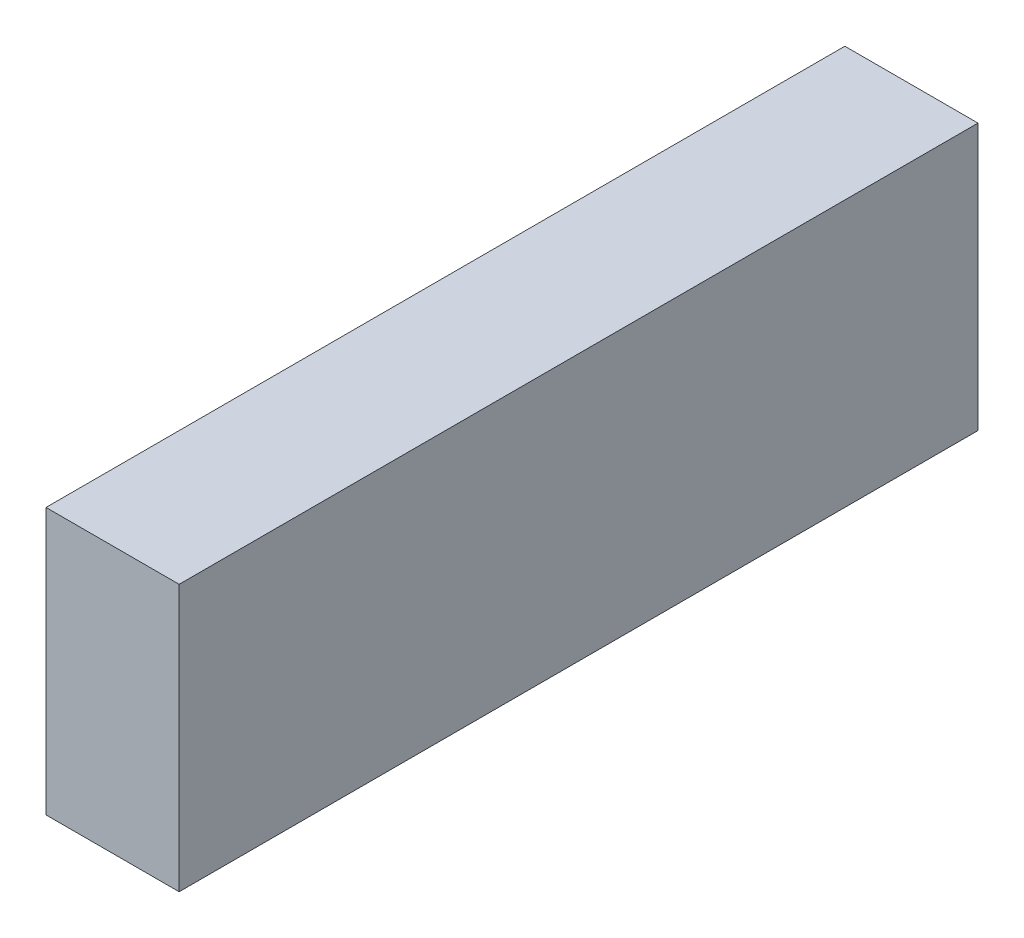
ISO-10303-21;
HEADER;
FILE_DESCRIPTION(('STEP AP214'),'2;1');
FILE_NAME('part.step','',(''),(''),'','','');
FILE_SCHEMA(('AUTOMOTIVE_DESIGN { 1 0 10303 214 1 1 1 1 }'));
ENDSEC;
DATA;
#1=APPLICATION_CONTEXT('core data for automotive mechanical design processes');
#2=APPLICATION_PROTOCOL_DEFINITION('international standard','automotive_design',2000,#1);
#3=PRODUCT_CONTEXT('',#1,'mechanical');
#4=PRODUCT('Part','Part','',(#3));
#5=PRODUCT_RELATED_PRODUCT_CATEGORY('part','',(#4));
#6=PRODUCT_DEFINITION_FORMATION('','',#4);
#7=PRODUCT_DEFINITION_CONTEXT('part definition',#1,'design');
#8=PRODUCT_DEFINITION('design','',#6,#7);
#9=PRODUCT_DEFINITION_SHAPE('','',#8);
#10=(LENGTH_UNIT() NAMED_UNIT(*) SI_UNIT(.MILLI.,.METRE.));
#11=(NAMED_UNIT(*) PLANE_ANGLE_UNIT() SI_UNIT($,.RADIAN.));
#12=(NAMED_UNIT(*) SI_UNIT($,.STERADIAN.) SOLID_ANGLE_UNIT());
#13=UNCERTAINTY_MEASURE_WITH_UNIT(LENGTH_MEASURE(1.E-05),#10,'distance_accuracy_value','');
#14=(GEOMETRIC_REPRESENTATION_CONTEXT(3) GLOBAL_UNCERTAINTY_ASSIGNED_CONTEXT((#13)) GLOBAL_UNIT_ASSIGNED_CONTEXT((#10,
#11,#12)) REPRESENTATION_CONTEXT('',''));
#15=CARTESIAN_POINT('',(0.,0.,0.));
#16=DIRECTION('',(0.,0.,1.));
#17=DIRECTION('',(1.,0.,0.));
#18=AXIS2_PLACEMENT_3D('',#15,#16,#17);
#19=CARTESIAN_POINT('',(220.,-32.3,392.64406037513));
#20=DIRECTION('',(0.,0.,-1.));
#21=DIRECTION('',(-1.,0.,0.));
#22=AXIS2_PLACEMENT_3D('',#19,#20,#21);
#23=PLANE('',#22);
#24=DIRECTION('',(0.,-1.,0.));
#25=VECTOR('',#24,1.);
#26=CARTESIAN_POINT('',(0.,-32.3,392.64406037513));
#27=LINE('',#26,#25);
#28=CARTESIAN_POINT('',(0.,407.7,392.64406037513));
#29=VERTEX_POINT('',#28);
#30=CARTESIAN_POINT('',(0.,-32.3,392.64406037513));
#31=VERTEX_POINT('',#30);
#32=EDGE_CURVE('E109',#29,#31,#27,.T.);
#33=ORIENTED_EDGE('',*,*,#32,.T.);
#34=DIRECTION('',(-1.,0.,0.));
#35=VECTOR('',#34,1.);
#36=CARTESIAN_POINT('',(220.,-32.3,392.64406037513));
#37=LINE('',#36,#35);
#38=CARTESIAN_POINT('',(220.,-32.3,392.64406037513));
#39=VERTEX_POINT('',#38);
#40=EDGE_CURVE('E12',#39,#31,#37,.T.);
#41=ORIENTED_EDGE('',*,*,#40,.F.);
#42=DIRECTION('',(0.,-1.,0.));
#43=VECTOR('',#42,1.);
#44=CARTESIAN_POINT('',(220.,-32.3,392.64406037513));
#45=LINE('',#44,#43);
#46=CARTESIAN_POINT('',(220.,407.7,392.64406037513));
#47=VERTEX_POINT('',#46);
#48=EDGE_CURVE('E97',#47,#39,#45,.T.);
#49=ORIENTED_EDGE('',*,*,#48,.F.);
#50=DIRECTION('',(-1.,0.,0.));
#51=VECTOR('',#50,1.);
#52=CARTESIAN_POINT('',(220.,407.7,392.64406037513));
#53=LINE('',#52,#51);
#54=EDGE_CURVE('E105',#47,#29,#53,.T.);
#55=ORIENTED_EDGE('',*,*,#54,.T.);
#56=EDGE_LOOP('',(#33,#41,#49,#55));
#57=FACE_BOUND('',#56,.T.);
#58=ADVANCED_FACE('F46',(#57),#23,.F.);
#59=CARTESIAN_POINT('',(220.,-32.3,392.64406037513));
#60=DIRECTION('',(0.,1.,0.));
#61=DIRECTION('',(0.,0.,1.));
#62=AXIS2_PLACEMENT_3D('',#59,#60,#61);
#63=PLANE('',#62);
#64=DIRECTION('',(0.,0.,-1.));
#65=VECTOR('',#64,1.);
#66=CARTESIAN_POINT('',(0.,-32.3,392.64406037513));
#67=LINE('',#66,#65);
#68=CARTESIAN_POINT('',(0.,-32.3,-487.35593962487));
#69=VERTEX_POINT('',#68);
#70=EDGE_CURVE('E101',#31,#69,#67,.T.);
#71=ORIENTED_EDGE('',*,*,#70,.T.);
#72=DIRECTION('',(-1.,0.,0.));
#73=VECTOR('',#72,1.);
#74=CARTESIAN_POINT('',(220.,-32.3,-487.35593962487));
#75=LINE('',#74,#73);
#76=CARTESIAN_POINT('',(220.,-32.3,-487.35593962487));
#77=VERTEX_POINT('',#76);
#78=EDGE_CURVE('E54',#77,#69,#75,.T.);
#79=ORIENTED_EDGE('',*,*,#78,.F.);
#80=DIRECTION('',(0.,0.,-1.));
#81=VECTOR('',#80,1.);
#82=CARTESIAN_POINT('',(220.,-32.3,392.64406037513));
#83=LINE('',#82,#81);
#84=EDGE_CURVE('E92',#39,#77,#83,.T.);
#85=ORIENTED_EDGE('',*,*,#84,.F.);
#86=ORIENTED_EDGE('',*,*,#40,.T.);
#87=EDGE_LOOP('',(#71,#79,#85,#86));
#88=FACE_BOUND('',#87,.T.);
#89=ADVANCED_FACE('F100',(#88),#63,.F.);
#90=CARTESIAN_POINT('',(220.,-32.3,-487.35593962487));
#91=DIRECTION('',(0.,0.,1.));
#92=DIRECTION('',(1.,0.,0.));
#93=AXIS2_PLACEMENT_3D('',#90,#91,#92);
#94=PLANE('',#93);
#95=DIRECTION('',(0.,1.,0.));
#96=VECTOR('',#95,1.);
#97=CARTESIAN_POINT('',(0.,-32.3,-487.35593962487));
#98=LINE('',#97,#96);
#99=CARTESIAN_POINT('',(0.,407.7,-487.35593962487));
#100=VERTEX_POINT('',#99);
#101=EDGE_CURVE('E79',#69,#100,#98,.T.);
#102=ORIENTED_EDGE('',*,*,#101,.T.);
#103=DIRECTION('',(-1.,0.,0.));
#104=VECTOR('',#103,1.);
#105=CARTESIAN_POINT('',(220.,407.7,-487.35593962487));
#106=LINE('',#105,#104);
#107=CARTESIAN_POINT('',(220.,407.7,-487.35593962487));
#108=VERTEX_POINT('',#107);
#109=EDGE_CURVE('E102',#108,#100,#106,.T.);
#110=ORIENTED_EDGE('',*,*,#109,.F.);
#111=DIRECTION('',(0.,1.,0.));
#112=VECTOR('',#111,1.);
#113=CARTESIAN_POINT('',(220.,-32.3,-487.35593962487));
#114=LINE('',#113,#112);
#115=EDGE_CURVE('E95',#77,#108,#114,.T.);
#116=ORIENTED_EDGE('',*,*,#115,.F.);
#117=ORIENTED_EDGE('',*,*,#78,.T.);
#118=EDGE_LOOP('',(#102,#110,#116,#117));
#119=FACE_BOUND('',#118,.T.);
#120=ADVANCED_FACE('F103',(#119),#94,.F.);
#121=CARTESIAN_POINT('',(220.,407.7,392.64406037513));
#122=DIRECTION('',(0.,-1.,0.));
#123=DIRECTION('',(0.,0.,-1.));
#124=AXIS2_PLACEMENT_3D('',#121,#122,#123);
#125=PLANE('',#124);
#126=DIRECTION('',(0.,0.,1.));
#127=VECTOR('',#126,1.);
#128=CARTESIAN_POINT('',(0.,407.7,392.64406037513));
#129=LINE('',#128,#127);
#130=EDGE_CURVE('E85',#100,#29,#129,.T.);
#131=ORIENTED_EDGE('',*,*,#130,.T.);
#132=ORIENTED_EDGE('',*,*,#54,.F.);
#133=DIRECTION('',(0.,0.,1.));
#134=VECTOR('',#133,1.);
#135=CARTESIAN_POINT('',(220.,407.7,392.64406037513));
#136=LINE('',#135,#134);
#137=EDGE_CURVE('E62',#108,#47,#136,.T.);
#138=ORIENTED_EDGE('',*,*,#137,.F.);
#139=ORIENTED_EDGE('',*,*,#109,.T.);
#140=EDGE_LOOP('',(#131,#132,#138,#139));
#141=FACE_BOUND('',#140,.T.);
#142=ADVANCED_FACE('F116',(#141),#125,.F.);
#143=CARTESIAN_POINT('',(220.,0.,0.));
#144=DIRECTION('',(-1.,0.,0.));
#145=DIRECTION('',(0.,0.,1.));
#146=AXIS2_PLACEMENT_3D('',#143,#144,#145);
#147=PLANE('',#146);
#148=ORIENTED_EDGE('',*,*,#48,.T.);
#149=ORIENTED_EDGE('',*,*,#84,.T.);
#150=ORIENTED_EDGE('',*,*,#115,.T.);
#151=ORIENTED_EDGE('',*,*,#137,.T.);
#152=EDGE_LOOP('',(#148,#149,#150,#151));
#153=FACE_BOUND('',#152,.T.);
#154=ADVANCED_FACE('F93',(#153),#147,.F.);
#155=CARTESIAN_POINT('',(0.,0.,0.));
#156=DIRECTION('',(-1.,0.,0.));
#157=DIRECTION('',(0.,0.,1.));
#158=AXIS2_PLACEMENT_3D('',#155,#156,#157);
#159=PLANE('',#158);
#160=ORIENTED_EDGE('',*,*,#32,.F.);
#161=ORIENTED_EDGE('',*,*,#130,.F.);
#162=ORIENTED_EDGE('',*,*,#101,.F.);
#163=ORIENTED_EDGE('',*,*,#70,.F.);
#164=EDGE_LOOP('',(#160,#161,#162,#163));
#165=FACE_BOUND('',#164,.T.);
#166=ADVANCED_FACE('F119',(#165),#159,.T.);
#167=CLOSED_SHELL('',(#58,#89,#120,#142,#154,#166));
#168=MANIFOLD_SOLID_BREP('B2_NOT_SHOWN',#167);
#169=CARTESIAN_POINT('',(1000.,-32.3,2192.64406037513));
#170=DIRECTION('',(0.,0.,-1.));
#171=DIRECTION('',(-1.,0.,0.));
#172=AXIS2_PLACEMENT_3D('',#169,#170,#171);
#173=PLANE('',#172);
#174=DIRECTION('',(0.,-1.,0.));
#175=VECTOR('',#174,1.);
#176=CARTESIAN_POINT('',(0.,-32.3,2192.64406037513));
#177=LINE('',#176,#175);
#178=CARTESIAN_POINT('',(0.,1967.7,2192.64406037513));
#179=VERTEX_POINT('',#178);
#180=CARTESIAN_POINT('',(0.,-32.3,2192.64406037513));
#181=VERTEX_POINT('',#180);
#182=EDGE_CURVE('E242',#179,#181,#177,.T.);
#183=ORIENTED_EDGE('',*,*,#182,.T.);
#184=DIRECTION('',(-1.,0.,0.));
#185=VECTOR('',#184,1.);
#186=CARTESIAN_POINT('',(1000.,-32.3,2192.64406037513));
#187=LINE('',#186,#185);
#188=CARTESIAN_POINT('',(1000.,-32.3,2192.64406037513));
#189=VERTEX_POINT('',#188);
#190=EDGE_CURVE('E44',#189,#181,#187,.T.);
#191=ORIENTED_EDGE('',*,*,#190,.F.);
#192=DIRECTION('',(0.,-1.,0.));
#193=VECTOR('',#192,1.);
#194=CARTESIAN_POINT('',(1000.,-32.3,2192.64406037513));
#195=LINE('',#194,#193);
#196=CARTESIAN_POINT('',(1000.,1967.7,2192.64406037513));
#197=VERTEX_POINT('',#196);
#198=EDGE_CURVE('E230',#197,#189,#195,.T.);
#199=ORIENTED_EDGE('',*,*,#198,.F.);
#200=DIRECTION('',(-1.,0.,0.));
#201=VECTOR('',#200,1.);
#202=CARTESIAN_POINT('',(1000.,1967.7,2192.64406037513));
#203=LINE('',#202,#201);
#204=EDGE_CURVE('E238',#197,#179,#203,.T.);
#205=ORIENTED_EDGE('',*,*,#204,.T.);
#206=EDGE_LOOP('',(#183,#191,#199,#205));
#207=FACE_BOUND('',#206,.T.);
#208=ADVANCED_FACE('F179',(#207),#173,.F.);
#209=CARTESIAN_POINT('',(1000.,-32.3,2192.64406037513));
#210=DIRECTION('',(0.,1.,0.));
#211=DIRECTION('',(0.,0.,1.));
#212=AXIS2_PLACEMENT_3D('',#209,#210,#211);
#213=PLANE('',#212);
#214=DIRECTION('',(0.,0.,-1.));
#215=VECTOR('',#214,1.);
#216=CARTESIAN_POINT('',(0.,-32.3,2192.64406037513));
#217=LINE('',#216,#215);
#218=CARTESIAN_POINT('',(0.,-32.3,-3807.35593962487));
#219=VERTEX_POINT('',#218);
#220=EDGE_CURVE('E234',#181,#219,#217,.T.);
#221=ORIENTED_EDGE('',*,*,#220,.T.);
#222=DIRECTION('',(-1.,0.,0.));
#223=VECTOR('',#222,1.);
#224=CARTESIAN_POINT('',(1000.,-32.3,-3807.35593962487));
#225=LINE('',#224,#223);
#226=CARTESIAN_POINT('',(1000.,-32.3,-3807.35593962487));
#227=VERTEX_POINT('',#226);
#228=EDGE_CURVE('E187',#227,#219,#225,.T.);
#229=ORIENTED_EDGE('',*,*,#228,.F.);
#230=DIRECTION('',(0.,0.,-1.));
#231=VECTOR('',#230,1.);
#232=CARTESIAN_POINT('',(1000.,-32.3,2192.64406037513));
#233=LINE('',#232,#231);
#234=EDGE_CURVE('E225',#189,#227,#233,.T.);
#235=ORIENTED_EDGE('',*,*,#234,.F.);
#236=ORIENTED_EDGE('',*,*,#190,.T.);
#237=EDGE_LOOP('',(#221,#229,#235,#236));
#238=FACE_BOUND('',#237,.T.);
#239=ADVANCED_FACE('F233',(#238),#213,.F.);
#240=CARTESIAN_POINT('',(1000.,-32.3,-3807.35593962487));
#241=DIRECTION('',(0.,0.,1.));
#242=DIRECTION('',(1.,0.,0.));
#243=AXIS2_PLACEMENT_3D('',#240,#241,#242);
#244=PLANE('',#243);
#245=DIRECTION('',(0.,1.,0.));
#246=VECTOR('',#245,1.);
#247=CARTESIAN_POINT('',(0.,-32.3,-3807.35593962487));
#248=LINE('',#247,#246);
#249=CARTESIAN_POINT('',(0.,1967.7,-3807.35593962487));
#250=VERTEX_POINT('',#249);
#251=EDGE_CURVE('E212',#219,#250,#248,.T.);
#252=ORIENTED_EDGE('',*,*,#251,.T.);
#253=DIRECTION('',(-1.,0.,0.));
#254=VECTOR('',#253,1.);
#255=CARTESIAN_POINT('',(1000.,1967.7,-3807.35593962487));
#256=LINE('',#255,#254);
#257=CARTESIAN_POINT('',(1000.,1967.7,-3807.35593962487));
#258=VERTEX_POINT('',#257);
#259=EDGE_CURVE('E235',#258,#250,#256,.T.);
#260=ORIENTED_EDGE('',*,*,#259,.F.);
#261=DIRECTION('',(0.,1.,0.));
#262=VECTOR('',#261,1.);
#263=CARTESIAN_POINT('',(1000.,-32.3,-3807.35593962487));
#264=LINE('',#263,#262);
#265=EDGE_CURVE('E228',#227,#258,#264,.T.);
#266=ORIENTED_EDGE('',*,*,#265,.F.);
#267=ORIENTED_EDGE('',*,*,#228,.T.);
#268=EDGE_LOOP('',(#252,#260,#266,#267));
#269=FACE_BOUND('',#268,.T.);
#270=ADVANCED_FACE('F236',(#269),#244,.F.);
#271=CARTESIAN_POINT('',(1000.,1967.7,2192.64406037513));
#272=DIRECTION('',(0.,-1.,0.));
#273=DIRECTION('',(0.,0.,-1.));
#274=AXIS2_PLACEMENT_3D('',#271,#272,#273);
#275=PLANE('',#274);
#276=DIRECTION('',(0.,0.,1.));
#277=VECTOR('',#276,1.);
#278=CARTESIAN_POINT('',(0.,1967.7,2192.64406037513));
#279=LINE('',#278,#277);
#280=EDGE_CURVE('E218',#250,#179,#279,.T.);
#281=ORIENTED_EDGE('',*,*,#280,.T.);
#282=ORIENTED_EDGE('',*,*,#204,.F.);
#283=DIRECTION('',(0.,0.,1.));
#284=VECTOR('',#283,1.);
#285=CARTESIAN_POINT('',(1000.,1967.7,2192.64406037513));
#286=LINE('',#285,#284);
#287=EDGE_CURVE('E195',#258,#197,#286,.T.);
#288=ORIENTED_EDGE('',*,*,#287,.F.);
#289=ORIENTED_EDGE('',*,*,#259,.T.);
#290=EDGE_LOOP('',(#281,#282,#288,#289));
#291=FACE_BOUND('',#290,.T.);
#292=ADVANCED_FACE('F249',(#291),#275,.F.);
#293=CARTESIAN_POINT('',(1000.,0.,0.));
#294=DIRECTION('',(-1.,0.,0.));
#295=DIRECTION('',(0.,0.,1.));
#296=AXIS2_PLACEMENT_3D('',#293,#294,#295);
#297=PLANE('',#296);
#298=ORIENTED_EDGE('',*,*,#198,.T.);
#299=ORIENTED_EDGE('',*,*,#234,.T.);
#300=ORIENTED_EDGE('',*,*,#265,.T.);
#301=ORIENTED_EDGE('',*,*,#287,.T.);
#302=EDGE_LOOP('',(#298,#299,#300,#301));
#303=FACE_BOUND('',#302,.T.);
#304=ADVANCED_FACE('F226',(#303),#297,.F.);
#305=CARTESIAN_POINT('',(0.,0.,0.));
#306=DIRECTION('',(-1.,0.,0.));
#307=DIRECTION('',(0.,0.,1.));
#308=AXIS2_PLACEMENT_3D('',#305,#306,#307);
#309=PLANE('',#308);
#310=ORIENTED_EDGE('',*,*,#182,.F.);
#311=ORIENTED_EDGE('',*,*,#280,.F.);
#312=ORIENTED_EDGE('',*,*,#251,.F.);
#313=ORIENTED_EDGE('',*,*,#220,.F.);
#314=EDGE_LOOP('',(#310,#311,#312,#313));
#315=FACE_BOUND('',#314,.T.);
#316=ADVANCED_FACE('F252',(#315),#309,.T.);
#317=CLOSED_SHELL('',(#208,#239,#270,#292,#304,#316));
#318=MANIFOLD_SOLID_BREP('B6_NOT_SHOWN',#317);
#319=CARTESIAN_POINT('',(69.,20.,0.));
#320=DIRECTION('',(0.,0.,1.));
#321=DIRECTION('',(1.,0.,0.));
#322=AXIS2_PLACEMENT_3D('',#319,#320,#321);
#323=PLANE('',#322);
#324=DIRECTION('',(-1.,0.,0.));
#325=VECTOR('',#324,1.);
#326=CARTESIAN_POINT('',(69.,81.9000000000002,0.));
#327=LINE('',#326,#325);
#328=CARTESIAN_POINT('',(69.,81.9000000000002,0.));
#329=VERTEX_POINT('',#328);
#330=CARTESIAN_POINT('',(-69.,81.9000000000001,0.));
#331=VERTEX_POINT('',#330);
#332=EDGE_CURVE('E543',#329,#331,#327,.T.);
#333=ORIENTED_EDGE('',*,*,#332,.T.);
#334=DIRECTION('',(0.,1.,0.));
#335=VECTOR('',#334,1.);
#336=CARTESIAN_POINT('',(-69.,20.,0.));
#337=LINE('',#336,#335);
#338=CARTESIAN_POINT('',(-69.,123.7,0.));
#339=VERTEX_POINT('',#338);
#340=EDGE_CURVE('E578',#331,#339,#337,.T.);
#341=ORIENTED_EDGE('',*,*,#340,.T.);
#342=DIRECTION('',(-1.,0.,0.));
#343=VECTOR('',#342,1.);
#344=CARTESIAN_POINT('',(69.,123.7,0.));
#345=LINE('',#344,#343);
#346=CARTESIAN_POINT('',(69.,123.7,0.));
#347=VERTEX_POINT('',#346);
#348=EDGE_CURVE('E614',#339,#347,#345,.F.);
#349=ORIENTED_EDGE('',*,*,#348,.T.);
#350=DIRECTION('',(0.,1.,0.));
#351=VECTOR('',#350,1.);
#352=CARTESIAN_POINT('',(69.,20.,0.));
#353=LINE('',#352,#351);
#354=EDGE_CURVE('E556',#329,#347,#353,.T.);
#355=ORIENTED_EDGE('',*,*,#354,.F.);
#356=EDGE_LOOP('',(#333,#341,#349,#355));
#357=FACE_BOUND('',#356,.T.);
#358=ADVANCED_FACE('F303',(#357),#323,.F.);
#359=CARTESIAN_POINT('',(69.,0.,0.));
#360=DIRECTION('',(0.,1.,0.));
#361=DIRECTION('',(0.,0.,1.));
#362=AXIS2_PLACEMENT_3D('',#359,#360,#361);
#363=PLANE('',#362);
#364=DIRECTION('',(-1.,0.,0.));
#365=VECTOR('',#364,1.);
#366=CARTESIAN_POINT('',(-48.6,0.,-106.65593962487));
#367=LINE('',#366,#365);
#368=CARTESIAN_POINT('',(-48.6,0.,-106.65593962487));
#369=VERTEX_POINT('',#368);
#370=CARTESIAN_POINT('',(-69.,0.,-106.65593962487));
#371=VERTEX_POINT('',#370);
#372=EDGE_CURVE('E499',#369,#371,#367,.T.);
#373=ORIENTED_EDGE('',*,*,#372,.T.);
#374=DIRECTION('',(0.,0.,-1.));
#375=VECTOR('',#374,1.);
#376=CARTESIAN_POINT('',(-69.,0.,0.));
#377=LINE('',#376,#375);
#378=CARTESIAN_POINT('',(-69.,0.,-203.2));
#379=VERTEX_POINT('',#378);
#380=EDGE_CURVE('E571',#371,#379,#377,.T.);
#381=ORIENTED_EDGE('',*,*,#380,.T.);
#382=DIRECTION('',(-1.,0.,0.));
#383=VECTOR('',#382,1.);
#384=CARTESIAN_POINT('',(69.,0.,-203.2));
#385=LINE('',#384,#383);
#386=CARTESIAN_POINT('',(69.,0.,-203.2));
#387=VERTEX_POINT('',#386);
#388=EDGE_CURVE('E569',#387,#379,#385,.T.);
#389=ORIENTED_EDGE('',*,*,#388,.F.);
#390=DIRECTION('',(0.,0.,-1.));
#391=VECTOR('',#390,1.);
#392=CARTESIAN_POINT('',(69.,0.,262.79362659682));
#393=LINE('',#392,#391);
#394=CARTESIAN_POINT('',(69.,0.,-106.65593962487));
#395=VERTEX_POINT('',#394);
#396=EDGE_CURVE('E467',#395,#387,#393,.T.);
#397=ORIENTED_EDGE('',*,*,#396,.F.);
#398=DIRECTION('',(1.,0.,0.));
#399=VECTOR('',#398,1.);
#400=CARTESIAN_POINT('',(48.6,0.,-106.65593962487));
#401=LINE('',#400,#399);
#402=CARTESIAN_POINT('',(48.6,0.,-106.65593962487));
#403=VERTEX_POINT('',#402);
#404=EDGE_CURVE('E525',#403,#395,#401,.T.);
#405=ORIENTED_EDGE('',*,*,#404,.F.);
#406=DIRECTION('',(0.,0.,1.));
#407=VECTOR('',#406,1.);
#408=CARTESIAN_POINT('',(48.6,0.,-42.0559396248703));
#409=LINE('',#408,#407);
#410=CARTESIAN_POINT('',(48.6,0.,-42.0559396248703));
#411=VERTEX_POINT('',#410);
#412=EDGE_CURVE('E522',#403,#411,#409,.T.);
#413=ORIENTED_EDGE('',*,*,#412,.T.);
#414=DIRECTION('',(1.,0.,0.));
#415=VECTOR('',#414,1.);
#416=CARTESIAN_POINT('',(48.6,0.,-42.0559396248703));
#417=LINE('',#416,#415);
#418=CARTESIAN_POINT('',(69.,0.,-42.0559396248703));
#419=VERTEX_POINT('',#418);
#420=EDGE_CURVE('E527',#411,#419,#417,.T.);
#421=ORIENTED_EDGE('',*,*,#420,.T.);
#422=CARTESIAN_POINT('',(69.,0.,160.34406037513));
#423=VERTEX_POINT('',#422);
#424=EDGE_CURVE('E553',#423,#419,#393,.T.);
#425=ORIENTED_EDGE('',*,*,#424,.F.);
#426=DIRECTION('',(1.,0.,0.));
#427=VECTOR('',#426,1.);
#428=CARTESIAN_POINT('',(48.6,0.,160.34406037513));
#429=LINE('',#428,#427);
#430=CARTESIAN_POINT('',(48.6,0.,160.34406037513));
#431=VERTEX_POINT('',#430);
#432=EDGE_CURVE('E538',#431,#423,#429,.T.);
#433=ORIENTED_EDGE('',*,*,#432,.F.);
#434=DIRECTION('',(0.,0.,1.));
#435=VECTOR('',#434,1.);
#436=CARTESIAN_POINT('',(48.6,0.,224.94406037513));
#437=LINE('',#436,#435);
#438=CARTESIAN_POINT('',(48.6,0.,224.94406037513));
#439=VERTEX_POINT('',#438);
#440=EDGE_CURVE('E535',#431,#439,#437,.T.);
#441=ORIENTED_EDGE('',*,*,#440,.T.);
#442=DIRECTION('',(1.,0.,0.));
#443=VECTOR('',#442,1.);
#444=CARTESIAN_POINT('',(48.6,0.,224.94406037513));
#445=LINE('',#444,#443);
#446=CARTESIAN_POINT('',(69.,0.,224.94406037513));
#447=VERTEX_POINT('',#446);
#448=EDGE_CURVE('E540',#439,#447,#445,.T.);
#449=ORIENTED_EDGE('',*,*,#448,.T.);
#450=CARTESIAN_POINT('',(69.,0.,262.79362659682));
#451=VERTEX_POINT('',#450);
#452=EDGE_CURVE('E471',#451,#447,#393,.T.);
#453=ORIENTED_EDGE('',*,*,#452,.F.);
#454=DIRECTION('',(-1.,0.,0.));
#455=VECTOR('',#454,1.);
#456=CARTESIAN_POINT('',(69.,0.,262.79362659682));
#457=LINE('',#456,#455);
#458=CARTESIAN_POINT('',(-69.,0.,262.79362659682));
#459=VERTEX_POINT('',#458);
#460=EDGE_CURVE('E592',#451,#459,#457,.T.);
#461=ORIENTED_EDGE('',*,*,#460,.T.);
#462=CARTESIAN_POINT('',(-69.,0.,224.94406037513));
#463=VERTEX_POINT('',#462);
#464=EDGE_CURVE('E572',#459,#463,#377,.T.);
#465=ORIENTED_EDGE('',*,*,#464,.T.);
#466=DIRECTION('',(-1.,0.,0.));
#467=VECTOR('',#466,1.);
#468=CARTESIAN_POINT('',(-48.6,0.,224.94406037513));
#469=LINE('',#468,#467);
#470=CARTESIAN_POINT('',(-48.6,0.,224.94406037513));
#471=VERTEX_POINT('',#470);
#472=EDGE_CURVE('E511',#471,#463,#469,.T.);
#473=ORIENTED_EDGE('',*,*,#472,.F.);
#474=DIRECTION('',(0.,0.,1.));
#475=VECTOR('',#474,1.);
#476=CARTESIAN_POINT('',(-48.6,0.,224.94406037513));
#477=LINE('',#476,#475);
#478=CARTESIAN_POINT('',(-48.6,0.,160.34406037513));
#479=VERTEX_POINT('',#478);
#480=EDGE_CURVE('E508',#479,#471,#477,.T.);
#481=ORIENTED_EDGE('',*,*,#480,.F.);
#482=DIRECTION('',(-1.,0.,0.));
#483=VECTOR('',#482,1.);
#484=CARTESIAN_POINT('',(-48.6,0.,160.34406037513));
#485=LINE('',#484,#483);
#486=CARTESIAN_POINT('',(-69.,0.,160.34406037513));
#487=VERTEX_POINT('',#486);
#488=EDGE_CURVE('E514',#479,#487,#485,.T.);
#489=ORIENTED_EDGE('',*,*,#488,.T.);
#490=CARTESIAN_POINT('',(-69.,0.,-42.0559396248703));
#491=VERTEX_POINT('',#490);
#492=EDGE_CURVE('E574',#487,#491,#377,.T.);
#493=ORIENTED_EDGE('',*,*,#492,.T.);
#494=DIRECTION('',(-1.,0.,0.));
#495=VECTOR('',#494,1.);
#496=CARTESIAN_POINT('',(-48.6,0.,-42.0559396248703));
#497=LINE('',#496,#495);
#498=CARTESIAN_POINT('',(-48.6,0.,-42.0559396248703));
#499=VERTEX_POINT('',#498);
#500=EDGE_CURVE('E496',#499,#491,#497,.T.);
#501=ORIENTED_EDGE('',*,*,#500,.F.);
#502=DIRECTION('',(0.,0.,1.));
#503=VECTOR('',#502,1.);
#504=CARTESIAN_POINT('',(-48.6,0.,-42.0559396248703));
#505=LINE('',#504,#503);
#506=EDGE_CURVE('E493',#369,#499,#505,.T.);
#507=ORIENTED_EDGE('',*,*,#506,.F.);
#508=EDGE_LOOP('',(#373,#381,#389,#397,#405,#413,#421,#425,#433,#441,#449,#453,#461,#465,#473,
#481,#489,#493,#501,#507));
#509=FACE_BOUND('',#508,.T.);
#510=ADVANCED_FACE('F669',(#509),#363,.F.);
#511=CARTESIAN_POINT('',(69.,15.7395723137565,255.14406037513));
#512=DIRECTION('',(-1.,0.,0.));
#513=DIRECTION('',(0.,0.,1.));
#514=AXIS2_PLACEMENT_3D('',#511,#512,#513);
#515=CYLINDRICAL_SURFACE('',#514,17.5);
#516=CARTESIAN_POINT('',(69.,15.7395723137565,255.14406037513));
#517=DIRECTION('',(1.,0.,0.));
#518=DIRECTION('',(0.,0.,-1.));
#519=AXIS2_PLACEMENT_3D('',#516,#517,#518);
#520=CIRCLE('',#519,17.5);
#521=CARTESIAN_POINT('',(69.,29.1597981364929,266.375602516206));
#522=VERTEX_POINT('',#521);
#523=EDGE_CURVE('E549',#522,#451,#520,.T.);
#524=ORIENTED_EDGE('',*,*,#523,.F.);
#525=DIRECTION('',(-1.,0.,0.));
#526=VECTOR('',#525,1.);
#527=CARTESIAN_POINT('',(69.,29.1597981364929,266.375602516206));
#528=LINE('',#527,#526);
#529=CARTESIAN_POINT('',(-69.,29.1597981364929,266.375602516206));
#530=VERTEX_POINT('',#529);
#531=EDGE_CURVE('E595',#522,#530,#528,.T.);
#532=ORIENTED_EDGE('',*,*,#531,.T.);
#533=CARTESIAN_POINT('',(-69.,15.7395723137565,255.14406037513));
#534=DIRECTION('',(1.,0.,0.));
#535=DIRECTION('',(0.,0.,-1.));
#536=AXIS2_PLACEMENT_3D('',#533,#534,#535);
#537=CIRCLE('',#536,17.5);
#538=EDGE_CURVE('E548',#530,#459,#537,.T.);
#539=ORIENTED_EDGE('',*,*,#538,.T.);
#540=ORIENTED_EDGE('',*,*,#460,.F.);
#541=EDGE_LOOP('',(#524,#532,#539,#540));
#542=FACE_BOUND('',#541,.T.);
#543=ADVANCED_FACE('F665',(#542),#515,.T.);
#544=CARTESIAN_POINT('',(69.,0.,-203.2));
#545=DIRECTION('',(0.,0.,1.));
#546=DIRECTION('',(1.,0.,0.));
#547=AXIS2_PLACEMENT_3D('',#544,#545,#546);
#548=PLANE('',#547);
#549=DIRECTION('',(0.,1.,0.));
#550=VECTOR('',#549,1.);
#551=CARTESIAN_POINT('',(-69.,0.,-203.2));
#552=LINE('',#551,#550);
#553=CARTESIAN_POINT('',(-69.,98.9,-203.2));
#554=VERTEX_POINT('',#553);
#555=EDGE_CURVE('E477',#379,#554,#552,.T.);
#556=ORIENTED_EDGE('',*,*,#555,.T.);
#557=DIRECTION('',(1.,0.,0.));
#558=VECTOR('',#557,1.);
#559=CARTESIAN_POINT('',(-88.723082923316,98.9,-203.2));
#560=LINE('',#559,#558);
#561=CARTESIAN_POINT('',(69.,98.9,-203.2));
#562=VERTEX_POINT('',#561);
#563=EDGE_CURVE('E474',#554,#562,#560,.T.);
#564=ORIENTED_EDGE('',*,*,#563,.T.);
#565=DIRECTION('',(0.,1.,0.));
#566=VECTOR('',#565,1.);
#567=CARTESIAN_POINT('',(69.,0.,-203.2));
#568=LINE('',#567,#566);
#569=EDGE_CURVE('E460',#387,#562,#568,.T.);
#570=ORIENTED_EDGE('',*,*,#569,.F.);
#571=ORIENTED_EDGE('',*,*,#388,.T.);
#572=EDGE_LOOP('',(#556,#564,#570,#571));
#573=FACE_BOUND('',#572,.T.);
#574=ADVANCED_FACE('F475',(#573),#548,.F.);
#575=CARTESIAN_POINT('',(69.,81.9,-203.2));
#576=DIRECTION('',(0.,-1.,0.));
#577=DIRECTION('',(0.,0.,-1.));
#578=AXIS2_PLACEMENT_3D('',#575,#576,#577);
#579=PLANE('',#578);
#580=DIRECTION('',(0.,0.,1.));
#581=VECTOR('',#580,1.);
#582=CARTESIAN_POINT('',(69.,81.9,-203.2));
#583=LINE('',#582,#581);
#584=CARTESIAN_POINT('',(69.,81.9,-193.2));
#585=VERTEX_POINT('',#584);
#586=EDGE_CURVE('E318',#585,#329,#583,.T.);
#587=ORIENTED_EDGE('',*,*,#586,.F.);
#588=DIRECTION('',(1.,0.,0.));
#589=VECTOR('',#588,1.);
#590=CARTESIAN_POINT('',(-88.723082923316,81.9,-193.2));
#591=LINE('',#590,#589);
#592=CARTESIAN_POINT('',(-69.,81.9,-193.2));
#593=VERTEX_POINT('',#592);
#594=EDGE_CURVE('E481',#593,#585,#591,.T.);
#595=ORIENTED_EDGE('',*,*,#594,.F.);
#596=DIRECTION('',(0.,0.,1.));
#597=VECTOR('',#596,1.);
#598=CARTESIAN_POINT('',(-69.,81.9,-203.2));
#599=LINE('',#598,#597);
#600=EDGE_CURVE('E576',#593,#331,#599,.T.);
#601=ORIENTED_EDGE('',*,*,#600,.T.);
#602=ORIENTED_EDGE('',*,*,#332,.F.);
#603=EDGE_LOOP('',(#587,#595,#601,#602));
#604=FACE_BOUND('',#603,.T.);
#605=ADVANCED_FACE('F686',(#604),#579,.F.);
#606=CARTESIAN_POINT('',(69.,133.7,0.));
#607=DIRECTION('',(0.,-1.,0.));
#608=DIRECTION('',(0.,0.,-1.));
#609=AXIS2_PLACEMENT_3D('',#606,#607,#608);
#610=PLANE('',#609);
#611=DIRECTION('',(0.,0.,1.));
#612=VECTOR('',#611,1.);
#613=CARTESIAN_POINT('',(69.,133.7,0.));
#614=LINE('',#613,#612);
#615=CARTESIAN_POINT('',(69.,133.7,10.));
#616=VERTEX_POINT('',#615);
#617=CARTESIAN_POINT('',(69.,133.7,111.84701211121));
#618=VERTEX_POINT('',#617);
#619=EDGE_CURVE('E558',#616,#618,#614,.T.);
#620=ORIENTED_EDGE('',*,*,#619,.F.);
#621=DIRECTION('',(-1.,0.,0.));
#622=VECTOR('',#621,1.);
#623=CARTESIAN_POINT('',(69.,133.7,10.));
#624=LINE('',#623,#622);
#625=CARTESIAN_POINT('',(-69.,133.7,10.));
#626=VERTEX_POINT('',#625);
#627=EDGE_CURVE('E605',#616,#626,#624,.T.);
#628=ORIENTED_EDGE('',*,*,#627,.T.);
#629=DIRECTION('',(0.,0.,1.));
#630=VECTOR('',#629,1.);
#631=CARTESIAN_POINT('',(-69.,133.7,0.));
#632=LINE('',#631,#630);
#633=CARTESIAN_POINT('',(-69.,133.7,111.84701211121));
#634=VERTEX_POINT('',#633);
#635=EDGE_CURVE('E581',#626,#634,#632,.T.);
#636=ORIENTED_EDGE('',*,*,#635,.T.);
#637=DIRECTION('',(-1.,0.,0.));
#638=VECTOR('',#637,1.);
#639=CARTESIAN_POINT('',(69.,133.7,111.84701211121));
#640=LINE('',#639,#638);
#641=EDGE_CURVE('E603',#634,#618,#640,.F.);
#642=ORIENTED_EDGE('',*,*,#641,.T.);
#643=EDGE_LOOP('',(#620,#628,#636,#642));
#644=FACE_BOUND('',#643,.T.);
#645=ADVANCED_FACE('F688',(#644),#610,.F.);
#646=CARTESIAN_POINT('',(69.,133.7,115.));
#647=DIRECTION('',(0.,-0.819152044288995,-0.573576436351042));
#648=DIRECTION('',(0.,0.573576436351042,-0.819152044288995));
#649=AXIS2_PLACEMENT_3D('',#646,#647,#648);
#650=PLANE('',#649);
#651=DIRECTION('',(0.,-0.573576436351042,0.819152044288994));
#652=VECTOR('',#651,1.);
#653=CARTESIAN_POINT('',(69.,133.7,115.));
#654=LINE('',#653,#652);
#655=CARTESIAN_POINT('',(69.,131.89152044289,117.582776474721));
#656=VERTEX_POINT('',#655);
#657=CARTESIAN_POINT('',(69.,95.7296916570861,169.227220175317));
#658=VERTEX_POINT('',#657);
#659=EDGE_CURVE('E561',#656,#658,#654,.T.);
#660=ORIENTED_EDGE('',*,*,#659,.F.);
#661=DIRECTION('',(-1.,0.,0.));
#662=VECTOR('',#661,1.);
#663=CARTESIAN_POINT('',(69.,131.89152044289,117.582776474721));
#664=LINE('',#663,#662);
#665=CARTESIAN_POINT('',(-69.,131.89152044289,117.582776474721));
#666=VERTEX_POINT('',#665);
#667=EDGE_CURVE('E624',#656,#666,#664,.T.);
#668=ORIENTED_EDGE('',*,*,#667,.T.);
#669=DIRECTION('',(0.,-0.573576436351042,0.819152044288994));
#670=VECTOR('',#669,1.);
#671=CARTESIAN_POINT('',(-69.,133.7,115.));
#672=LINE('',#671,#670);
#673=CARTESIAN_POINT('',(-69.,95.7296916570861,169.227220175317));
#674=VERTEX_POINT('',#673);
#675=EDGE_CURVE('E584',#666,#674,#672,.T.);
#676=ORIENTED_EDGE('',*,*,#675,.T.);
#677=DIRECTION('',(-1.,0.,0.));
#678=VECTOR('',#677,1.);
#679=CARTESIAN_POINT('',(69.,95.7296916570861,169.227220175317));
#680=LINE('',#679,#678);
#681=EDGE_CURVE('E622',#674,#658,#680,.F.);
#682=ORIENTED_EDGE('',*,*,#681,.T.);
#683=EDGE_LOOP('',(#660,#668,#676,#682));
#684=FACE_BOUND('',#683,.T.);
#685=ADVANCED_FACE('F644',(#684),#650,.F.);
#686=CARTESIAN_POINT('',(69.,94.3526564663185,171.193830238225));
#687=DIRECTION('',(0.,-0.990268068741571,-0.139173100960059));
#688=DIRECTION('',(0.,0.139173100960059,-0.990268068741571));
#689=AXIS2_PLACEMENT_3D('',#686,#687,#688);
#690=PLANE('',#689);
#691=DIRECTION('',(0.,-0.139173100960059,0.990268068741571));
#692=VECTOR('',#691,1.);
#693=CARTESIAN_POINT('',(69.,94.3526564663185,171.193830238225));
#694=LINE('',#693,#692);
#695=CARTESIAN_POINT('',(69.,94.0185314125603,173.571253529226));
#696=VERTEX_POINT('',#695);
#697=CARTESIAN_POINT('',(69.,82.6889579367665,254.185357606421));
#698=VERTEX_POINT('',#697);
#699=EDGE_CURVE('E564',#696,#698,#694,.T.);
#700=ORIENTED_EDGE('',*,*,#699,.F.);
#701=DIRECTION('',(-1.,0.,0.));
#702=VECTOR('',#701,1.);
#703=CARTESIAN_POINT('',(-69.,94.0185314125603,173.571253529226));
#704=LINE('',#703,#702);
#705=CARTESIAN_POINT('',(-69.,94.0185314125603,173.571253529226));
#706=VERTEX_POINT('',#705);
#707=EDGE_CURVE('E628',#696,#706,#704,.T.);
#708=ORIENTED_EDGE('',*,*,#707,.T.);
#709=DIRECTION('',(0.,-0.139173100960059,0.990268068741571));
#710=VECTOR('',#709,1.);
#711=CARTESIAN_POINT('',(-69.,94.3526564663185,171.193830238225));
#712=LINE('',#711,#710);
#713=CARTESIAN_POINT('',(-69.,82.6889579367665,254.185357606421));
#714=VERTEX_POINT('',#713);
#715=EDGE_CURVE('E587',#706,#714,#712,.T.);
#716=ORIENTED_EDGE('',*,*,#715,.T.);
#717=DIRECTION('',(-1.,0.,0.));
#718=VECTOR('',#717,1.);
#719=CARTESIAN_POINT('',(69.,82.6889579367665,254.185357606421));
#720=LINE('',#719,#718);
#721=EDGE_CURVE('E326',#714,#698,#720,.F.);
#722=ORIENTED_EDGE('',*,*,#721,.T.);
#723=EDGE_LOOP('',(#700,#708,#716,#722));
#724=FACE_BOUND('',#723,.T.);
#725=ADVANCED_FACE('F649',(#724),#690,.F.);
#726=CARTESIAN_POINT('',(69.,81.4791446275131,262.79362659682));
#727=DIRECTION('',(0.,0.,-1.));
#728=DIRECTION('',(0.,1.,0.));
#729=AXIS2_PLACEMENT_3D('',#726,#727,#728);
#730=PLANE('',#729);
#731=DIRECTION('',(0.,-1.,0.));
#732=VECTOR('',#731,1.);
#733=CARTESIAN_POINT('',(-69.,81.4791446275131,262.79362659682));
#734=LINE('',#733,#732);
#735=CARTESIAN_POINT('',(-69.,72.7862772493507,262.79362659682));
#736=VERTEX_POINT('',#735);
#737=CARTESIAN_POINT('',(-69.,36.8284986066279,262.79362659682));
#738=VERTEX_POINT('',#737);
#739=EDGE_CURVE('E551',#736,#738,#734,.T.);
#740=ORIENTED_EDGE('',*,*,#739,.T.);
#741=DIRECTION('',(1.,0.,0.));
#742=VECTOR('',#741,1.);
#743=CARTESIAN_POINT('',(69.,36.8284986066279,262.79362659682));
#744=LINE('',#743,#742);
#745=CARTESIAN_POINT('',(69.,36.8284986066279,262.79362659682));
#746=VERTEX_POINT('',#745);
#747=EDGE_CURVE('E601',#738,#746,#744,.T.);
#748=ORIENTED_EDGE('',*,*,#747,.T.);
#749=DIRECTION('',(0.,-1.,0.));
#750=VECTOR('',#749,1.);
#751=CARTESIAN_POINT('',(69.,81.4791446275131,262.79362659682));
#752=LINE('',#751,#750);
#753=CARTESIAN_POINT('',(69.,72.7862772493507,262.79362659682));
#754=VERTEX_POINT('',#753);
#755=EDGE_CURVE('E566',#754,#746,#752,.T.);
#756=ORIENTED_EDGE('',*,*,#755,.F.);
#757=DIRECTION('',(-1.,0.,0.));
#758=VECTOR('',#757,1.);
#759=CARTESIAN_POINT('',(69.,72.7862772493507,262.79362659682));
#760=LINE('',#759,#758);
#761=EDGE_CURVE('E598',#754,#736,#760,.T.);
#762=ORIENTED_EDGE('',*,*,#761,.T.);
#763=EDGE_LOOP('',(#740,#748,#756,#762));
#764=FACE_BOUND('',#763,.T.);
#765=ADVANCED_FACE('F655',(#764),#730,.F.);
#766=CARTESIAN_POINT('',(69.,15.7395723137565,255.14406037513));
#767=DIRECTION('',(1.,0.,0.));
#768=DIRECTION('',(0.,0.,-1.));
#769=AXIS2_PLACEMENT_3D('',#766,#767,#768);
#770=PLANE('',#769);
#771=ORIENTED_EDGE('',*,*,#354,.T.);
#772=CARTESIAN_POINT('',(69.,123.7,10.));
#773=DIRECTION('',(1.,0.,0.));
#774=DIRECTION('',(0.,0.,-1.));
#775=AXIS2_PLACEMENT_3D('',#772,#773,#774);
#776=CIRCLE('',#775,10.);
#777=EDGE_CURVE('E620',#347,#616,#776,.T.);
#778=ORIENTED_EDGE('',*,*,#777,.T.);
#779=ORIENTED_EDGE('',*,*,#619,.T.);
#780=CARTESIAN_POINT('',(69.,123.7,111.84701211121));
#781=DIRECTION('',(1.,0.,0.));
#782=DIRECTION('',(0.,0.,-1.));
#783=AXIS2_PLACEMENT_3D('',#780,#781,#782);
#784=CIRCLE('',#783,10.);
#785=EDGE_CURVE('E618',#618,#656,#784,.T.);
#786=ORIENTED_EDGE('',*,*,#785,.T.);
#787=ORIENTED_EDGE('',*,*,#659,.T.);
#788=CARTESIAN_POINT('',(69.,103.921212099976,174.962984538827));
#789=DIRECTION('',(1.,0.,0.));
#790=DIRECTION('',(0.,0.,-1.));
#791=AXIS2_PLACEMENT_3D('',#788,#789,#790);
#792=CIRCLE('',#791,10.);
#793=EDGE_CURVE('E177',#658,#696,#792,.F.);
#794=ORIENTED_EDGE('',*,*,#793,.T.);
#795=ORIENTED_EDGE('',*,*,#699,.T.);
#796=CARTESIAN_POINT('',(69.,72.7862772493507,252.79362659682));
#797=DIRECTION('',(1.,0.,0.));
#798=DIRECTION('',(0.,0.,-1.));
#799=AXIS2_PLACEMENT_3D('',#796,#797,#798);
#800=CIRCLE('',#799,10.);
#801=EDGE_CURVE('E616',#698,#754,#800,.T.);
#802=ORIENTED_EDGE('',*,*,#801,.T.);
#803=ORIENTED_EDGE('',*,*,#755,.T.);
#804=CARTESIAN_POINT('',(69.,36.8284986066279,272.79362659682));
#805=DIRECTION('',(1.,0.,0.));
#806=DIRECTION('',(0.,0.,-1.));
#807=AXIS2_PLACEMENT_3D('',#804,#805,#806);
#808=CIRCLE('',#807,10.);
#809=EDGE_CURVE('E633',#746,#522,#808,.F.);
#810=ORIENTED_EDGE('',*,*,#809,.T.);
#811=ORIENTED_EDGE('',*,*,#523,.T.);
#812=ORIENTED_EDGE('',*,*,#452,.T.);
#813=CARTESIAN_POINT('',(69.,0.,192.64406037513));
#814=DIRECTION('',(1.,0.,0.));
#815=DIRECTION('',(0.,0.,-1.));
#816=AXIS2_PLACEMENT_3D('',#813,#814,#815);
#817=CIRCLE('',#816,32.3);
#818=EDGE_CURVE('E530',#447,#423,#817,.T.);
#819=ORIENTED_EDGE('',*,*,#818,.T.);
#820=ORIENTED_EDGE('',*,*,#424,.T.);
#821=CARTESIAN_POINT('',(69.,0.,-74.3559396248702));
#822=DIRECTION('',(1.,0.,0.));
#823=DIRECTION('',(0.,0.,-1.));
#824=AXIS2_PLACEMENT_3D('',#821,#822,#823);
#825=CIRCLE('',#824,32.3);
#826=EDGE_CURVE('E517',#419,#395,#825,.T.);
#827=ORIENTED_EDGE('',*,*,#826,.T.);
#828=ORIENTED_EDGE('',*,*,#396,.T.);
#829=ORIENTED_EDGE('',*,*,#569,.T.);
#830=DIRECTION('',(0.,-0.861934215157769,0.507020126563394));
#831=VECTOR('',#830,1.);
#832=CARTESIAN_POINT('',(69.,81.9,-193.2));
#833=LINE('',#832,#831);
#834=EDGE_CURVE('E465',#562,#585,#833,.T.);
#835=ORIENTED_EDGE('',*,*,#834,.T.);
#836=ORIENTED_EDGE('',*,*,#586,.T.);
#837=EDGE_LOOP('',(#771,#778,#779,#786,#787,#794,#795,#802,#803,#810,#811,#812,#819,#820,#827,
#828,#829,#835,#836));
#838=FACE_BOUND('',#837,.T.);
#839=ADVANCED_FACE('F463',(#838),#770,.T.);
#840=CARTESIAN_POINT('',(-69.,15.7395723137565,255.14406037513));
#841=DIRECTION('',(1.,0.,0.));
#842=DIRECTION('',(0.,0.,-1.));
#843=AXIS2_PLACEMENT_3D('',#840,#841,#842);
#844=PLANE('',#843);
#845=ORIENTED_EDGE('',*,*,#635,.F.);
#846=CARTESIAN_POINT('',(-69.,123.7,10.));
#847=DIRECTION('',(1.,0.,0.));
#848=DIRECTION('',(0.,0.,-1.));
#849=AXIS2_PLACEMENT_3D('',#846,#847,#848);
#850=CIRCLE('',#849,10.);
#851=EDGE_CURVE('E612',#626,#339,#850,.F.);
#852=ORIENTED_EDGE('',*,*,#851,.T.);
#853=ORIENTED_EDGE('',*,*,#340,.F.);
#854=ORIENTED_EDGE('',*,*,#600,.F.);
#855=DIRECTION('',(0.,0.861934215157769,-0.507020126563394));
#856=VECTOR('',#855,1.);
#857=CARTESIAN_POINT('',(-69.,81.9,-193.2));
#858=LINE('',#857,#856);
#859=EDGE_CURVE('E486',#593,#554,#858,.T.);
#860=ORIENTED_EDGE('',*,*,#859,.T.);
#861=ORIENTED_EDGE('',*,*,#555,.F.);
#862=ORIENTED_EDGE('',*,*,#380,.F.);
#863=CARTESIAN_POINT('',(-69.,0.,-74.3559396248702));
#864=DIRECTION('',(1.,0.,0.));
#865=DIRECTION('',(0.,0.,-1.));
#866=AXIS2_PLACEMENT_3D('',#863,#864,#865);
#867=CIRCLE('',#866,32.3);
#868=EDGE_CURVE('E489',#491,#371,#867,.T.);
#869=ORIENTED_EDGE('',*,*,#868,.F.);
#870=ORIENTED_EDGE('',*,*,#492,.F.);
#871=CARTESIAN_POINT('',(-69.,0.,192.64406037513));
#872=DIRECTION('',(1.,0.,0.));
#873=DIRECTION('',(0.,0.,-1.));
#874=AXIS2_PLACEMENT_3D('',#871,#872,#873);
#875=CIRCLE('',#874,32.3);
#876=EDGE_CURVE('E502',#463,#487,#875,.T.);
#877=ORIENTED_EDGE('',*,*,#876,.F.);
#878=ORIENTED_EDGE('',*,*,#464,.F.);
#879=ORIENTED_EDGE('',*,*,#538,.F.);
#880=CARTESIAN_POINT('',(-69.,36.8284986066279,272.79362659682));
#881=DIRECTION('',(1.,0.,0.));
#882=DIRECTION('',(0.,0.,-1.));
#883=AXIS2_PLACEMENT_3D('',#880,#881,#882);
#884=CIRCLE('',#883,10.);
#885=EDGE_CURVE('E631',#530,#738,#884,.T.);
#886=ORIENTED_EDGE('',*,*,#885,.T.);
#887=ORIENTED_EDGE('',*,*,#739,.F.);
#888=CARTESIAN_POINT('',(-69.,72.7862772493507,252.79362659682));
#889=DIRECTION('',(1.,0.,0.));
#890=DIRECTION('',(0.,0.,-1.));
#891=AXIS2_PLACEMENT_3D('',#888,#889,#890);
#892=CIRCLE('',#891,10.);
#893=EDGE_CURVE('E608',#736,#714,#892,.F.);
#894=ORIENTED_EDGE('',*,*,#893,.T.);
#895=ORIENTED_EDGE('',*,*,#715,.F.);
#896=CARTESIAN_POINT('',(-69.,103.921212099976,174.962984538827));
#897=DIRECTION('',(1.,0.,0.));
#898=DIRECTION('',(0.,0.,-1.));
#899=AXIS2_PLACEMENT_3D('',#896,#897,#898);
#900=CIRCLE('',#899,10.);
#901=EDGE_CURVE('E311',#706,#674,#900,.T.);
#902=ORIENTED_EDGE('',*,*,#901,.T.);
#903=ORIENTED_EDGE('',*,*,#675,.F.);
#904=CARTESIAN_POINT('',(-69.,123.7,111.84701211121));
#905=DIRECTION('',(1.,0.,0.));
#906=DIRECTION('',(0.,0.,-1.));
#907=AXIS2_PLACEMENT_3D('',#904,#905,#906);
#908=CIRCLE('',#907,10.);
#909=EDGE_CURVE('E610',#666,#634,#908,.F.);
#910=ORIENTED_EDGE('',*,*,#909,.T.);
#911=EDGE_LOOP('',(#845,#852,#853,#854,#860,#861,#862,#869,#870,#877,#878,#879,#886,#887,#894,
#895,#902,#903,#910));
#912=FACE_BOUND('',#911,.T.);
#913=ADVANCED_FACE('F638',(#912),#844,.F.);
#914=CARTESIAN_POINT('',(48.6,0.,192.64406037513));
#915=DIRECTION('',(1.,0.,0.));
#916=DIRECTION('',(0.,0.,-1.));
#917=AXIS2_PLACEMENT_3D('',#914,#915,#916);
#918=CYLINDRICAL_SURFACE('',#917,32.3);
#919=ORIENTED_EDGE('',*,*,#818,.F.);
#920=ORIENTED_EDGE('',*,*,#448,.F.);
#921=CARTESIAN_POINT('',(48.6,0.,192.64406037513));
#922=DIRECTION('',(1.,0.,0.));
#923=DIRECTION('',(0.,0.,-1.));
#924=AXIS2_PLACEMENT_3D('',#921,#922,#923);
#925=CIRCLE('',#924,32.3);
#926=EDGE_CURVE('E533',#439,#431,#925,.T.);
#927=ORIENTED_EDGE('',*,*,#926,.T.);
#928=ORIENTED_EDGE('',*,*,#432,.T.);
#929=EDGE_LOOP('',(#919,#920,#927,#928));
#930=FACE_BOUND('',#929,.T.);
#931=ADVANCED_FACE('F674',(#930),#918,.T.);
#932=CARTESIAN_POINT('',(48.6,0.,192.64406037513));
#933=DIRECTION('',(1.,0.,0.));
#934=DIRECTION('',(0.,0.,-1.));
#935=AXIS2_PLACEMENT_3D('',#932,#933,#934);
#936=PLANE('',#935);
#937=ORIENTED_EDGE('',*,*,#926,.F.);
#938=ORIENTED_EDGE('',*,*,#440,.F.);
#939=EDGE_LOOP('',(#937,#938));
#940=FACE_BOUND('',#939,.T.);
#941=ADVANCED_FACE('F717',(#940),#936,.F.);
#942=CARTESIAN_POINT('',(48.6,0.,-74.3559396248702));
#943=DIRECTION('',(1.,0.,0.));
#944=DIRECTION('',(0.,0.,-1.));
#945=AXIS2_PLACEMENT_3D('',#942,#943,#944);
#946=CYLINDRICAL_SURFACE('',#945,32.3);
#947=ORIENTED_EDGE('',*,*,#826,.F.);
#948=ORIENTED_EDGE('',*,*,#420,.F.);
#949=CARTESIAN_POINT('',(48.6,0.,-74.3559396248702));
#950=DIRECTION('',(1.,0.,0.));
#951=DIRECTION('',(0.,0.,-1.));
#952=AXIS2_PLACEMENT_3D('',#949,#950,#951);
#953=CIRCLE('',#952,32.3);
#954=EDGE_CURVE('E520',#411,#403,#953,.T.);
#955=ORIENTED_EDGE('',*,*,#954,.T.);
#956=ORIENTED_EDGE('',*,*,#404,.T.);
#957=EDGE_LOOP('',(#947,#948,#955,#956));
#958=FACE_BOUND('',#957,.T.);
#959=ADVANCED_FACE('F681',(#958),#946,.T.);
#960=CARTESIAN_POINT('',(48.6,0.,-74.3559396248702));
#961=DIRECTION('',(1.,0.,0.));
#962=DIRECTION('',(0.,0.,-1.));
#963=AXIS2_PLACEMENT_3D('',#960,#961,#962);
#964=PLANE('',#963);
#965=ORIENTED_EDGE('',*,*,#954,.F.);
#966=ORIENTED_EDGE('',*,*,#412,.F.);
#967=EDGE_LOOP('',(#965,#966));
#968=FACE_BOUND('',#967,.T.);
#969=ADVANCED_FACE('F683',(#968),#964,.F.);
#970=CARTESIAN_POINT('',(-48.6,0.,192.64406037513));
#971=DIRECTION('',(-1.,0.,0.));
#972=DIRECTION('',(0.,0.,1.));
#973=AXIS2_PLACEMENT_3D('',#970,#971,#972);
#974=CYLINDRICAL_SURFACE('',#973,32.3);
#975=ORIENTED_EDGE('',*,*,#876,.T.);
#976=ORIENTED_EDGE('',*,*,#488,.F.);
#977=CARTESIAN_POINT('',(-48.6,0.,192.64406037513));
#978=DIRECTION('',(1.,0.,0.));
#979=DIRECTION('',(0.,0.,-1.));
#980=AXIS2_PLACEMENT_3D('',#977,#978,#979);
#981=CIRCLE('',#980,32.3);
#982=EDGE_CURVE('E505',#471,#479,#981,.T.);
#983=ORIENTED_EDGE('',*,*,#982,.F.);
#984=ORIENTED_EDGE('',*,*,#472,.T.);
#985=EDGE_LOOP('',(#975,#976,#983,#984));
#986=FACE_BOUND('',#985,.T.);
#987=ADVANCED_FACE('F725',(#986),#974,.T.);
#988=CARTESIAN_POINT('',(-48.6,0.,192.64406037513));
#989=DIRECTION('',(-1.,0.,0.));
#990=DIRECTION('',(0.,0.,-1.));
#991=AXIS2_PLACEMENT_3D('',#988,#989,#990);
#992=PLANE('',#991);
#993=ORIENTED_EDGE('',*,*,#982,.T.);
#994=ORIENTED_EDGE('',*,*,#480,.T.);
#995=EDGE_LOOP('',(#993,#994));
#996=FACE_BOUND('',#995,.T.);
#997=ADVANCED_FACE('F728',(#996),#992,.F.);
#998=CARTESIAN_POINT('',(-48.6,0.,-74.3559396248702));
#999=DIRECTION('',(-1.,0.,0.));
#1000=DIRECTION('',(0.,0.,1.));
#1001=AXIS2_PLACEMENT_3D('',#998,#999,#1000);
#1002=CYLINDRICAL_SURFACE('',#1001,32.3);
#1003=ORIENTED_EDGE('',*,*,#868,.T.);
#1004=ORIENTED_EDGE('',*,*,#372,.F.);
#1005=CARTESIAN_POINT('',(-48.6,0.,-74.3559396248702));
#1006=DIRECTION('',(1.,0.,0.));
#1007=DIRECTION('',(0.,0.,-1.));
#1008=AXIS2_PLACEMENT_3D('',#1005,#1006,#1007);
#1009=CIRCLE('',#1008,32.3);
#1010=EDGE_CURVE('E490',#499,#369,#1009,.T.);
#1011=ORIENTED_EDGE('',*,*,#1010,.F.);
#1012=ORIENTED_EDGE('',*,*,#500,.T.);
#1013=EDGE_LOOP('',(#1003,#1004,#1011,#1012));
#1014=FACE_BOUND('',#1013,.T.);
#1015=ADVANCED_FACE('F732',(#1014),#1002,.T.);
#1016=CARTESIAN_POINT('',(-48.6,0.,-74.3559396248702));
#1017=DIRECTION('',(-1.,0.,0.));
#1018=DIRECTION('',(0.,0.,-1.));
#1019=AXIS2_PLACEMENT_3D('',#1016,#1017,#1018);
#1020=PLANE('',#1019);
#1021=ORIENTED_EDGE('',*,*,#1010,.T.);
#1022=ORIENTED_EDGE('',*,*,#506,.T.);
#1023=EDGE_LOOP('',(#1021,#1022));
#1024=FACE_BOUND('',#1023,.T.);
#1025=ADVANCED_FACE('F736',(#1024),#1020,.F.);
#1026=CARTESIAN_POINT('',(69.,36.8284986066279,272.79362659682));
#1027=DIRECTION('',(-1.,0.,0.));
#1028=DIRECTION('',(0.,0.,1.));
#1029=AXIS2_PLACEMENT_3D('',#1026,#1027,#1028);
#1030=CYLINDRICAL_SURFACE('',#1029,10.);
#1031=ORIENTED_EDGE('',*,*,#809,.F.);
#1032=ORIENTED_EDGE('',*,*,#747,.F.);
#1033=ORIENTED_EDGE('',*,*,#885,.F.);
#1034=ORIENTED_EDGE('',*,*,#531,.F.);
#1035=EDGE_LOOP('',(#1031,#1032,#1033,#1034));
#1036=FACE_BOUND('',#1035,.T.);
#1037=ADVANCED_FACE('F659',(#1036),#1030,.F.);
#1038=CARTESIAN_POINT('',(69.,123.7,10.));
#1039=DIRECTION('',(-1.,0.,0.));
#1040=DIRECTION('',(0.,0.,1.));
#1041=AXIS2_PLACEMENT_3D('',#1038,#1039,#1040);
#1042=CYLINDRICAL_SURFACE('',#1041,10.);
#1043=ORIENTED_EDGE('',*,*,#777,.F.);
#1044=ORIENTED_EDGE('',*,*,#348,.F.);
#1045=ORIENTED_EDGE('',*,*,#851,.F.);
#1046=ORIENTED_EDGE('',*,*,#627,.F.);
#1047=EDGE_LOOP('',(#1043,#1044,#1045,#1046));
#1048=FACE_BOUND('',#1047,.T.);
#1049=ADVANCED_FACE('F752',(#1048),#1042,.T.);
#1050=CARTESIAN_POINT('',(69.,123.7,111.84701211121));
#1051=DIRECTION('',(-1.,0.,0.));
#1052=DIRECTION('',(0.,0.,1.));
#1053=AXIS2_PLACEMENT_3D('',#1050,#1051,#1052);
#1054=CYLINDRICAL_SURFACE('',#1053,10.);
#1055=ORIENTED_EDGE('',*,*,#785,.F.);
#1056=ORIENTED_EDGE('',*,*,#641,.F.);
#1057=ORIENTED_EDGE('',*,*,#909,.F.);
#1058=ORIENTED_EDGE('',*,*,#667,.F.);
#1059=EDGE_LOOP('',(#1055,#1056,#1057,#1058));
#1060=FACE_BOUND('',#1059,.T.);
#1061=ADVANCED_FACE('F748',(#1060),#1054,.T.);
#1062=CARTESIAN_POINT('',(69.,103.921212099976,174.962984538827));
#1063=DIRECTION('',(1.,0.,0.));
#1064=DIRECTION('',(0.,0.,-1.));
#1065=AXIS2_PLACEMENT_3D('',#1062,#1063,#1064);
#1066=CYLINDRICAL_SURFACE('',#1065,10.);
#1067=ORIENTED_EDGE('',*,*,#793,.F.);
#1068=ORIENTED_EDGE('',*,*,#681,.F.);
#1069=ORIENTED_EDGE('',*,*,#901,.F.);
#1070=ORIENTED_EDGE('',*,*,#707,.F.);
#1071=EDGE_LOOP('',(#1067,#1068,#1069,#1070));
#1072=FACE_BOUND('',#1071,.T.);
#1073=ADVANCED_FACE('F647',(#1072),#1066,.F.);
#1074=CARTESIAN_POINT('',(69.,72.7862772493507,252.79362659682));
#1075=DIRECTION('',(-1.,0.,0.));
#1076=DIRECTION('',(0.,0.,1.));
#1077=AXIS2_PLACEMENT_3D('',#1074,#1075,#1076);
#1078=CYLINDRICAL_SURFACE('',#1077,10.);
#1079=ORIENTED_EDGE('',*,*,#801,.F.);
#1080=ORIENTED_EDGE('',*,*,#721,.F.);
#1081=ORIENTED_EDGE('',*,*,#893,.F.);
#1082=ORIENTED_EDGE('',*,*,#761,.F.);
#1083=EDGE_LOOP('',(#1079,#1080,#1081,#1082));
#1084=FACE_BOUND('',#1083,.T.);
#1085=ADVANCED_FACE('F305',(#1084),#1078,.T.);
#1086=CARTESIAN_POINT('',(-88.723082923316,81.9,-193.2));
#1087=DIRECTION('',(0.,0.507020126563394,0.861934215157769));
#1088=DIRECTION('',(0.,-0.861934215157769,0.507020126563394));
#1089=AXIS2_PLACEMENT_3D('',#1086,#1087,#1088);
#1090=PLANE('',#1089);
#1091=ORIENTED_EDGE('',*,*,#859,.F.);
#1092=ORIENTED_EDGE('',*,*,#594,.T.);
#1093=ORIENTED_EDGE('',*,*,#834,.F.);
#1094=ORIENTED_EDGE('',*,*,#563,.F.);
#1095=EDGE_LOOP('',(#1091,#1092,#1093,#1094));
#1096=FACE_BOUND('',#1095,.T.);
#1097=ADVANCED_FACE('F483',(#1096),#1090,.T.);
#1098=CLOSED_SHELL('',(#358,#510,#543,#574,#605,#645,#685,#725,#765,#839,#913,#931,#941,#959,
#969,#987,#997,#1015,#1025,#1037,#1049,#1061,#1073,#1085,#1097));
#1099=MANIFOLD_SOLID_BREP('B38',#1098);
#1100=ADVANCED_BREP_SHAPE_REPRESENTATION('',(#18,#168,#318,#1099),#14);
#1101=SHAPE_DEFINITION_REPRESENTATION(#9,#1100);
ENDSEC;
END-ISO-10303-21;
